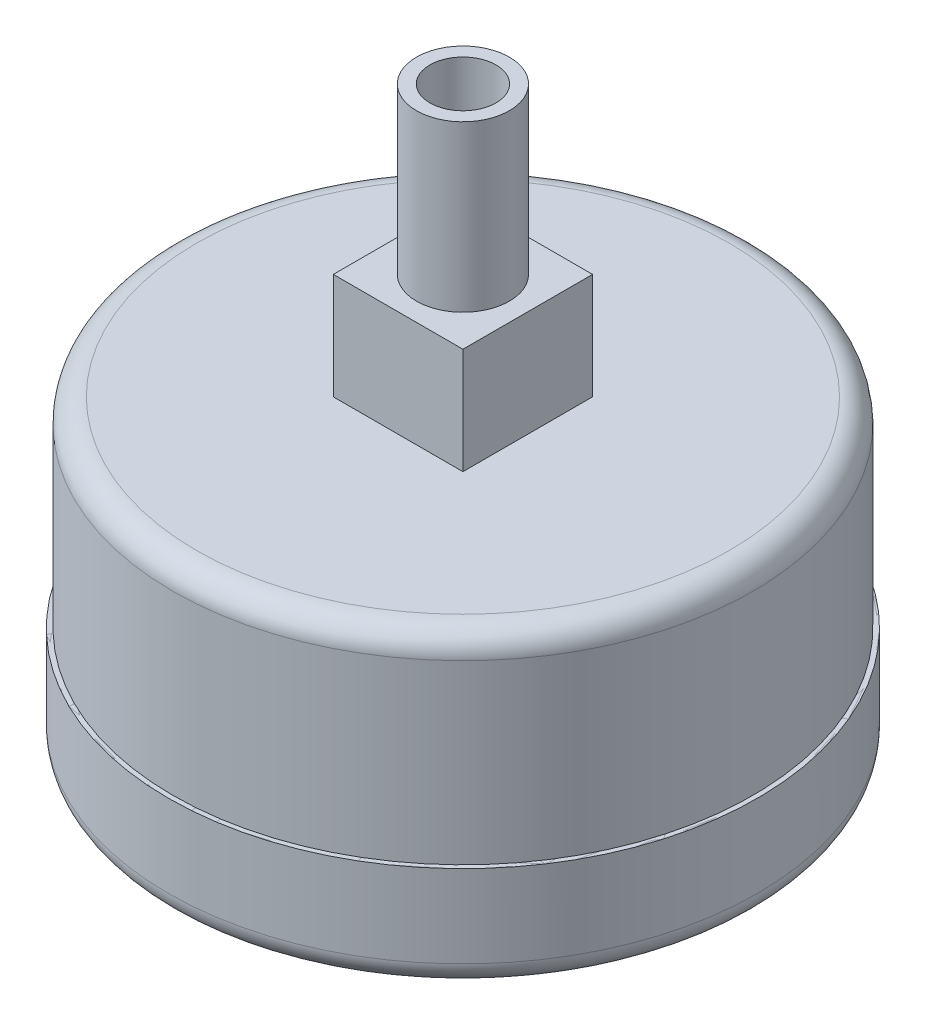
ISO-10303-21;
HEADER;
FILE_DESCRIPTION(('STEP AP214'),'2;1');
FILE_NAME('part.step','',(''),(''),'','','');
FILE_SCHEMA(('AUTOMOTIVE_DESIGN { 1 0 10303 214 1 1 1 1 }'));
ENDSEC;
DATA;
#1=APPLICATION_CONTEXT('core data for automotive mechanical design processes');
#2=APPLICATION_PROTOCOL_DEFINITION('international standard','automotive_design',2000,#1);
#3=PRODUCT_CONTEXT('',#1,'mechanical');
#4=PRODUCT('Part','Part','',(#3));
#5=PRODUCT_RELATED_PRODUCT_CATEGORY('part','',(#4));
#6=PRODUCT_DEFINITION_FORMATION('','',#4);
#7=PRODUCT_DEFINITION_CONTEXT('part definition',#1,'design');
#8=PRODUCT_DEFINITION('design','',#6,#7);
#9=PRODUCT_DEFINITION_SHAPE('','',#8);
#10=(LENGTH_UNIT() NAMED_UNIT(*) SI_UNIT(.MILLI.,.METRE.));
#11=(NAMED_UNIT(*) PLANE_ANGLE_UNIT() SI_UNIT($,.RADIAN.));
#12=(NAMED_UNIT(*) SI_UNIT($,.STERADIAN.) SOLID_ANGLE_UNIT());
#13=UNCERTAINTY_MEASURE_WITH_UNIT(LENGTH_MEASURE(1.E-05),#10,'distance_accuracy_value','');
#14=(GEOMETRIC_REPRESENTATION_CONTEXT(3) GLOBAL_UNCERTAINTY_ASSIGNED_CONTEXT((#13)) GLOBAL_UNIT_ASSIGNED_CONTEXT((#10,
#11,#12)) REPRESENTATION_CONTEXT('',''));
#15=CARTESIAN_POINT('',(0.,0.,0.));
#16=DIRECTION('',(0.,0.,1.));
#17=DIRECTION('',(1.,0.,0.));
#18=AXIS2_PLACEMENT_3D('',#15,#16,#17);
#19=CARTESIAN_POINT('',(0.,11.43,0.));
#20=DIRECTION('',(0.,1.,0.));
#21=DIRECTION('',(0.,0.,1.));
#22=AXIS2_PLACEMENT_3D('',#19,#20,#21);
#23=PLANE('',#22);
#24=CARTESIAN_POINT('',(0.,11.43,0.));
#25=DIRECTION('',(0.,1.,0.));
#26=DIRECTION('',(0.,0.,1.));
#27=AXIS2_PLACEMENT_3D('',#24,#25,#26);
#28=CIRCLE('',#27,31.75);
#29=CARTESIAN_POINT('',(0.,11.43,31.75));
#30=VERTEX_POINT('',#29);
#31=EDGE_CURVE('P0_E12',#30,#30,#28,.T.);
#32=ORIENTED_EDGE('',*,*,#31,.T.);
#33=EDGE_LOOP('',(#32));
#34=FACE_BOUND('',#33,.T.);
#35=ADVANCED_FACE('P0_F38',(#34),#23,.T.);
#36=OPEN_SHELL('',(#35));
#37=SHELL_BASED_SURFACE_MODEL('P0_B2',(#36));
#38=CARTESIAN_POINT('',(0.,44.45,0.));
#39=DIRECTION('',(0.,-1.,0.));
#40=DIRECTION('',(0.,0.,-1.));
#41=AXIS2_PLACEMENT_3D('',#38,#39,#40);
#42=PLANE('',#41);
#43=CARTESIAN_POINT('',(0.,44.45,0.));
#44=DIRECTION('',(0.,-1.,0.));
#45=DIRECTION('',(0.,0.,-1.));
#46=AXIS2_PLACEMENT_3D('',#43,#44,#45);
#47=CIRCLE('',#46,3.556);
#48=CARTESIAN_POINT('',(0.,44.45,-3.556));
#49=VERTEX_POINT('',#48);
#50=EDGE_CURVE('P1_E109',#49,#49,#47,.F.);
#51=ORIENTED_EDGE('',*,*,#50,.T.);
#52=EDGE_LOOP('',(#51));
#53=FACE_BOUND('',#52,.T.);
#54=ADVANCED_FACE('P1_F16',(#53),#42,.F.);
#55=CARTESIAN_POINT('',(0.,53.34,0.));
#56=DIRECTION('',(0.,-1.,0.));
#57=DIRECTION('',(0.,0.,-1.));
#58=AXIS2_PLACEMENT_3D('',#55,#56,#57);
#59=CYLINDRICAL_SURFACE('',#58,3.556);
#60=CARTESIAN_POINT('',(0.,62.23,0.));
#61=DIRECTION('',(0.,-1.,0.));
#62=DIRECTION('',(0.,0.,-1.));
#63=AXIS2_PLACEMENT_3D('',#60,#61,#62);
#64=CIRCLE('',#63,3.556);
#65=CARTESIAN_POINT('',(0.,62.23,-3.556));
#66=VERTEX_POINT('',#65);
#67=EDGE_CURVE('P1_E106',#66,#66,#64,.T.);
#68=ORIENTED_EDGE('',*,*,#67,.F.);
#69=EDGE_LOOP('',(#68));
#70=FACE_BOUND('',#69,.T.);
#71=ORIENTED_EDGE('',*,*,#50,.F.);
#72=EDGE_LOOP('',(#71));
#73=FACE_BOUND('',#72,.T.);
#74=ADVANCED_FACE('P1_F300',(#70,#73),#59,.F.);
#75=CARTESIAN_POINT('',(0.,62.23,2.5019));
#76=DIRECTION('',(0.,1.,0.));
#77=DIRECTION('',(0.,0.,1.));
#78=AXIS2_PLACEMENT_3D('',#75,#76,#77);
#79=PLANE('',#78);
#80=CARTESIAN_POINT('',(0.,62.23,0.));
#81=DIRECTION('',(0.,1.,0.));
#82=DIRECTION('',(0.,0.,1.));
#83=AXIS2_PLACEMENT_3D('',#80,#81,#82);
#84=CIRCLE('',#83,5.0038);
#85=CARTESIAN_POINT('',(0.,62.23,5.0038));
#86=VERTEX_POINT('',#85);
#87=EDGE_CURVE('P1_E103',#86,#86,#84,.F.);
#88=ORIENTED_EDGE('',*,*,#87,.F.);
#89=EDGE_LOOP('',(#88));
#90=FACE_BOUND('',#89,.T.);
#91=ORIENTED_EDGE('',*,*,#67,.T.);
#92=EDGE_LOOP('',(#91));
#93=FACE_BOUND('',#92,.T.);
#94=ADVANCED_FACE('P1_F289',(#90,#93),#79,.T.);
#95=CARTESIAN_POINT('',(0.,53.34,0.));
#96=DIRECTION('',(0.,1.,0.));
#97=DIRECTION('',(0.,0.,1.));
#98=AXIS2_PLACEMENT_3D('',#95,#96,#97);
#99=CYLINDRICAL_SURFACE('',#98,5.0038);
#100=ORIENTED_EDGE('',*,*,#87,.T.);
#101=EDGE_LOOP('',(#100));
#102=FACE_BOUND('',#101,.T.);
#103=CARTESIAN_POINT('',(0.,44.45,0.));
#104=DIRECTION('',(0.,1.,0.));
#105=DIRECTION('',(0.,0.,1.));
#106=AXIS2_PLACEMENT_3D('',#103,#104,#105);
#107=CIRCLE('',#106,5.0038);
#108=CARTESIAN_POINT('',(0.,44.45,5.0038));
#109=VERTEX_POINT('',#108);
#110=EDGE_CURVE('P1_E79',#109,#109,#107,.T.);
#111=ORIENTED_EDGE('',*,*,#110,.T.);
#112=EDGE_LOOP('',(#111));
#113=FACE_BOUND('',#112,.T.);
#114=ADVANCED_FACE('P1_F284',(#102,#113),#99,.T.);
#115=CARTESIAN_POINT('',(0.,44.45,0.));
#116=DIRECTION('',(0.,-1.,0.));
#117=DIRECTION('',(0.,0.,-1.));
#118=AXIS2_PLACEMENT_3D('',#115,#116,#117);
#119=PLANE('',#118);
#120=ORIENTED_EDGE('',*,*,#110,.F.);
#121=EDGE_LOOP('',(#120));
#122=FACE_BOUND('',#121,.T.);
#123=DIRECTION('',(0.,0.,1.));
#124=VECTOR('',#123,1.);
#125=CARTESIAN_POINT('',(6.985,44.45,0.));
#126=LINE('',#125,#124);
#127=CARTESIAN_POINT('',(6.985,44.45,6.985));
#128=VERTEX_POINT('',#127);
#129=CARTESIAN_POINT('',(6.985,44.45,-6.985));
#130=VERTEX_POINT('',#129);
#131=EDGE_CURVE('P1_E70',#128,#130,#126,.F.);
#132=ORIENTED_EDGE('',*,*,#131,.T.);
#133=DIRECTION('',(1.,0.,0.));
#134=VECTOR('',#133,1.);
#135=CARTESIAN_POINT('',(0.,44.45,-6.985));
#136=LINE('',#135,#134);
#137=CARTESIAN_POINT('',(-6.985,44.45,-6.985));
#138=VERTEX_POINT('',#137);
#139=EDGE_CURVE('P1_E172',#130,#138,#136,.F.);
#140=ORIENTED_EDGE('',*,*,#139,.T.);
#141=DIRECTION('',(0.,0.,-1.));
#142=VECTOR('',#141,1.);
#143=CARTESIAN_POINT('',(-6.985,44.45,0.));
#144=LINE('',#143,#142);
#145=CARTESIAN_POINT('',(-6.985,44.45,6.985));
#146=VERTEX_POINT('',#145);
#147=EDGE_CURVE('P1_E82',#138,#146,#144,.F.);
#148=ORIENTED_EDGE('',*,*,#147,.T.);
#149=DIRECTION('',(-1.,0.,0.));
#150=VECTOR('',#149,1.);
#151=CARTESIAN_POINT('',(0.,44.45,6.985));
#152=LINE('',#151,#150);
#153=EDGE_CURVE('P1_E65',#146,#128,#152,.F.);
#154=ORIENTED_EDGE('',*,*,#153,.T.);
#155=EDGE_LOOP('',(#132,#140,#148,#154));
#156=FACE_BOUND('',#155,.T.);
#157=ADVANCED_FACE('P1_F81',(#122,#156),#119,.F.);
#158=CARTESIAN_POINT('',(6.985,38.735,0.));
#159=DIRECTION('',(-1.,0.,0.));
#160=DIRECTION('',(0.,0.,1.));
#161=AXIS2_PLACEMENT_3D('',#158,#159,#160);
#162=PLANE('',#161);
#163=DIRECTION('',(0.,1.,0.));
#164=VECTOR('',#163,1.);
#165=CARTESIAN_POINT('',(6.985,38.735,6.985));
#166=LINE('',#165,#164);
#167=CARTESIAN_POINT('',(6.985,33.02,6.985));
#168=VERTEX_POINT('',#167);
#169=EDGE_CURVE('P1_E72',#128,#168,#166,.F.);
#170=ORIENTED_EDGE('',*,*,#169,.T.);
#171=DIRECTION('',(0.,0.,1.));
#172=VECTOR('',#171,1.);
#173=CARTESIAN_POINT('',(6.985,33.02,14.351));
#174=LINE('',#173,#172);
#175=CARTESIAN_POINT('',(6.985,33.02,-6.985));
#176=VERTEX_POINT('',#175);
#177=EDGE_CURVE('P1_E179',#176,#168,#174,.T.);
#178=ORIENTED_EDGE('',*,*,#177,.F.);
#179=DIRECTION('',(0.,1.,0.));
#180=VECTOR('',#179,1.);
#181=CARTESIAN_POINT('',(6.985,38.735,-6.985));
#182=LINE('',#181,#180);
#183=EDGE_CURVE('P1_E75',#176,#130,#182,.T.);
#184=ORIENTED_EDGE('',*,*,#183,.T.);
#185=ORIENTED_EDGE('',*,*,#131,.F.);
#186=EDGE_LOOP('',(#170,#178,#184,#185));
#187=FACE_BOUND('',#186,.T.);
#188=ADVANCED_FACE('P1_F71',(#187),#162,.F.);
#189=CARTESIAN_POINT('',(0.,38.735,6.985));
#190=DIRECTION('',(0.,0.,-1.));
#191=DIRECTION('',(-1.,0.,0.));
#192=AXIS2_PLACEMENT_3D('',#189,#190,#191);
#193=PLANE('',#192);
#194=DIRECTION('',(0.,1.,0.));
#195=VECTOR('',#194,1.);
#196=CARTESIAN_POINT('',(-6.985,38.735,6.985));
#197=LINE('',#196,#195);
#198=CARTESIAN_POINT('',(-6.985,33.02,6.985));
#199=VERTEX_POINT('',#198);
#200=EDGE_CURVE('P1_E84',#146,#199,#197,.F.);
#201=ORIENTED_EDGE('',*,*,#200,.T.);
#202=DIRECTION('',(1.,0.,0.));
#203=VECTOR('',#202,1.);
#204=CARTESIAN_POINT('',(0.,33.02,6.985));
#205=LINE('',#204,#203);
#206=EDGE_CURVE('P1_E88',#168,#199,#205,.F.);
#207=ORIENTED_EDGE('',*,*,#206,.F.);
#208=ORIENTED_EDGE('',*,*,#169,.F.);
#209=ORIENTED_EDGE('',*,*,#153,.F.);
#210=EDGE_LOOP('',(#201,#207,#208,#209));
#211=FACE_BOUND('',#210,.T.);
#212=ADVANCED_FACE('P1_F86',(#211),#193,.F.);
#213=CARTESIAN_POINT('',(-6.985,38.735,0.));
#214=DIRECTION('',(1.,0.,0.));
#215=DIRECTION('',(0.,0.,-1.));
#216=AXIS2_PLACEMENT_3D('',#213,#214,#215);
#217=PLANE('',#216);
#218=DIRECTION('',(0.,1.,0.));
#219=VECTOR('',#218,1.);
#220=CARTESIAN_POINT('',(-6.985,38.735,-6.985));
#221=LINE('',#220,#219);
#222=CARTESIAN_POINT('',(-6.985,33.02,-6.985));
#223=VERTEX_POINT('',#222);
#224=EDGE_CURVE('P1_E181',#138,#223,#221,.F.);
#225=ORIENTED_EDGE('',*,*,#224,.T.);
#226=DIRECTION('',(0.,0.,1.));
#227=VECTOR('',#226,1.);
#228=CARTESIAN_POINT('',(-6.985,33.02,14.351));
#229=LINE('',#228,#227);
#230=EDGE_CURVE('P1_E186',#199,#223,#229,.F.);
#231=ORIENTED_EDGE('',*,*,#230,.F.);
#232=ORIENTED_EDGE('',*,*,#200,.F.);
#233=ORIENTED_EDGE('',*,*,#147,.F.);
#234=EDGE_LOOP('',(#225,#231,#232,#233));
#235=FACE_BOUND('',#234,.T.);
#236=ADVANCED_FACE('P1_F187',(#235),#217,.F.);
#237=CARTESIAN_POINT('',(0.,38.735,-6.985));
#238=DIRECTION('',(0.,0.,1.));
#239=DIRECTION('',(1.,0.,0.));
#240=AXIS2_PLACEMENT_3D('',#237,#238,#239);
#241=PLANE('',#240);
#242=ORIENTED_EDGE('',*,*,#183,.F.);
#243=DIRECTION('',(1.,0.,0.));
#244=VECTOR('',#243,1.);
#245=CARTESIAN_POINT('',(0.,33.02,-6.985));
#246=LINE('',#245,#244);
#247=EDGE_CURVE('P1_E192',#223,#176,#246,.T.);
#248=ORIENTED_EDGE('',*,*,#247,.F.);
#249=ORIENTED_EDGE('',*,*,#224,.F.);
#250=ORIENTED_EDGE('',*,*,#139,.F.);
#251=EDGE_LOOP('',(#242,#248,#249,#250));
#252=FACE_BOUND('',#251,.T.);
#253=ADVANCED_FACE('P1_F217',(#252),#241,.F.);
#254=CARTESIAN_POINT('',(0.,33.02,14.351));
#255=DIRECTION('',(0.,1.,0.));
#256=DIRECTION('',(0.,0.,1.));
#257=AXIS2_PLACEMENT_3D('',#254,#255,#256);
#258=PLANE('',#257);
#259=ORIENTED_EDGE('',*,*,#230,.T.);
#260=ORIENTED_EDGE('',*,*,#247,.T.);
#261=ORIENTED_EDGE('',*,*,#177,.T.);
#262=ORIENTED_EDGE('',*,*,#206,.T.);
#263=EDGE_LOOP('',(#259,#260,#261,#262));
#264=FACE_BOUND('',#263,.T.);
#265=CARTESIAN_POINT('',(0.,33.02,0.));
#266=DIRECTION('',(0.,-1.,0.));
#267=DIRECTION('',(0.,0.,-1.));
#268=AXIS2_PLACEMENT_3D('',#265,#266,#267);
#269=CIRCLE('',#268,28.702);
#270=CARTESIAN_POINT('',(0.,33.02,-28.702));
#271=VERTEX_POINT('',#270);
#272=CARTESIAN_POINT('',(0.,33.02,28.702));
#273=VERTEX_POINT('',#272);
#274=EDGE_CURVE('P1_E198',#271,#273,#269,.T.);
#275=ORIENTED_EDGE('',*,*,#274,.F.);
#276=CARTESIAN_POINT('',(0.,33.02,0.));
#277=DIRECTION('',(0.,-1.,0.));
#278=DIRECTION('',(0.,0.,1.));
#279=AXIS2_PLACEMENT_3D('',#276,#277,#278);
#280=CIRCLE('',#279,28.702);
#281=EDGE_CURVE('P1_E150',#273,#271,#280,.T.);
#282=ORIENTED_EDGE('',*,*,#281,.F.);
#283=EDGE_LOOP('',(#275,#282));
#284=FACE_BOUND('',#283,.T.);
#285=ADVANCED_FACE('P1_F160',(#264,#284),#258,.T.);
#286=CARTESIAN_POINT('',(0.,30.48,0.));
#287=DIRECTION('',(0.,1.,0.));
#288=DIRECTION('',(0.,0.,-1.));
#289=AXIS2_PLACEMENT_3D('',#286,#287,#288);
#290=TOROIDAL_SURFACE('',#289,28.702,2.54);
#291=CARTESIAN_POINT('',(0.,30.48,0.));
#292=DIRECTION('',(0.,1.,0.));
#293=DIRECTION('',(0.,0.,1.));
#294=AXIS2_PLACEMENT_3D('',#291,#292,#293);
#295=CIRCLE('',#294,31.242);
#296=CARTESIAN_POINT('',(0.,30.48,31.242));
#297=VERTEX_POINT('',#296);
#298=EDGE_CURVE('P1_E100',#297,#297,#295,.F.);
#299=ORIENTED_EDGE('',*,*,#298,.F.);
#300=EDGE_LOOP('',(#299));
#301=FACE_BOUND('',#300,.T.);
#302=ORIENTED_EDGE('',*,*,#281,.T.);
#303=ORIENTED_EDGE('',*,*,#274,.T.);
#304=EDGE_LOOP('',(#302,#303));
#305=FACE_BOUND('',#304,.T.);
#306=ADVANCED_FACE('P1_F154',(#301,#305),#290,.T.);
#307=CARTESIAN_POINT('',(0.,20.955,0.));
#308=DIRECTION('',(0.,1.,0.));
#309=DIRECTION('',(0.,0.,1.));
#310=AXIS2_PLACEMENT_3D('',#307,#308,#309);
#311=CYLINDRICAL_SURFACE('',#310,31.242);
#312=ORIENTED_EDGE('',*,*,#298,.T.);
#313=EDGE_LOOP('',(#312));
#314=FACE_BOUND('',#313,.T.);
#315=CARTESIAN_POINT('',(0.,11.43,0.));
#316=DIRECTION('',(0.,1.,0.));
#317=DIRECTION('',(0.,0.,1.));
#318=AXIS2_PLACEMENT_3D('',#315,#316,#317);
#319=CIRCLE('',#318,31.242);
#320=CARTESIAN_POINT('',(0.,11.43,31.242));
#321=VERTEX_POINT('',#320);
#322=EDGE_CURVE('P1_E97',#321,#321,#319,.F.);
#323=ORIENTED_EDGE('',*,*,#322,.F.);
#324=EDGE_LOOP('',(#323));
#325=FACE_BOUND('',#324,.T.);
#326=ADVANCED_FACE('P1_F159',(#314,#325),#311,.T.);
#327=CARTESIAN_POINT('',(0.,11.43,31.496));
#328=DIRECTION('',(0.,1.,0.));
#329=DIRECTION('',(0.,0.,1.));
#330=AXIS2_PLACEMENT_3D('',#327,#328,#329);
#331=PLANE('',#330);
#332=CARTESIAN_POINT('',(0.,11.43,0.));
#333=DIRECTION('',(0.,1.,0.));
#334=DIRECTION('',(0.,0.,1.));
#335=AXIS2_PLACEMENT_3D('',#332,#333,#334);
#336=CIRCLE('',#335,31.75);
#337=CARTESIAN_POINT('',(0.,11.43,31.75));
#338=VERTEX_POINT('',#337);
#339=EDGE_CURVE('P1_E93',#338,#338,#336,.F.);
#340=ORIENTED_EDGE('',*,*,#339,.F.);
#341=EDGE_LOOP('',(#340));
#342=FACE_BOUND('',#341,.T.);
#343=ORIENTED_EDGE('',*,*,#322,.T.);
#344=EDGE_LOOP('',(#343));
#345=FACE_BOUND('',#344,.T.);
#346=ADVANCED_FACE('P1_F252',(#342,#345),#331,.T.);
#347=CARTESIAN_POINT('',(0.,6.985,0.));
#348=DIRECTION('',(0.,1.,0.));
#349=DIRECTION('',(0.,0.,1.));
#350=AXIS2_PLACEMENT_3D('',#347,#348,#349);
#351=CYLINDRICAL_SURFACE('',#350,31.75);
#352=ORIENTED_EDGE('',*,*,#339,.T.);
#353=EDGE_LOOP('',(#352));
#354=FACE_BOUND('',#353,.T.);
#355=CARTESIAN_POINT('',(0.,2.54,0.));
#356=DIRECTION('',(0.,1.,0.));
#357=DIRECTION('',(0.,0.,-1.));
#358=AXIS2_PLACEMENT_3D('',#355,#356,#357);
#359=CIRCLE('',#358,31.75);
#360=CARTESIAN_POINT('',(0.,2.54000000000001,-31.75));
#361=VERTEX_POINT('',#360);
#362=EDGE_CURVE('P1_E96',#361,#361,#359,.F.);
#363=ORIENTED_EDGE('',*,*,#362,.F.);
#364=EDGE_LOOP('',(#363));
#365=FACE_BOUND('',#364,.T.);
#366=ADVANCED_FACE('P1_F128',(#354,#365),#351,.T.);
#367=CARTESIAN_POINT('',(0.,2.54,0.));
#368=DIRECTION('',(0.,1.,0.));
#369=DIRECTION('',(0.,0.,-1.));
#370=AXIS2_PLACEMENT_3D('',#367,#368,#369);
#371=TOROIDAL_SURFACE('',#370,29.21,2.54);
#372=CARTESIAN_POINT('',(0.,0.,0.));
#373=DIRECTION('',(0.,1.,0.));
#374=DIRECTION('',(0.,0.,1.));
#375=AXIS2_PLACEMENT_3D('',#372,#373,#374);
#376=CIRCLE('',#375,29.21);
#377=CARTESIAN_POINT('',(0.,0.,-29.21));
#378=VERTEX_POINT('',#377);
#379=CARTESIAN_POINT('',(0.,0.,29.21));
#380=VERTEX_POINT('',#379);
#381=EDGE_CURVE('P1_E27',#378,#380,#376,.F.);
#382=ORIENTED_EDGE('',*,*,#381,.F.);
#383=CARTESIAN_POINT('',(0.,0.,0.));
#384=DIRECTION('',(0.,1.,0.));
#385=DIRECTION('',(0.,0.,-1.));
#386=AXIS2_PLACEMENT_3D('',#383,#384,#385);
#387=CIRCLE('',#386,29.21);
#388=EDGE_CURVE('P1_E11',#380,#378,#387,.F.);
#389=ORIENTED_EDGE('',*,*,#388,.F.);
#390=EDGE_LOOP('',(#382,#389));
#391=FACE_BOUND('',#390,.T.);
#392=ORIENTED_EDGE('',*,*,#362,.T.);
#393=EDGE_LOOP('',(#392));
#394=FACE_BOUND('',#393,.T.);
#395=ADVANCED_FACE('P1_F116',(#391,#394),#371,.T.);
#396=CARTESIAN_POINT('',(0.,0.,14.605));
#397=DIRECTION('',(0.,-1.,0.));
#398=DIRECTION('',(0.,0.,-1.));
#399=AXIS2_PLACEMENT_3D('',#396,#397,#398);
#400=PLANE('',#399);
#401=ORIENTED_EDGE('',*,*,#381,.T.);
#402=ORIENTED_EDGE('',*,*,#388,.T.);
#403=EDGE_LOOP('',(#401,#402));
#404=FACE_BOUND('',#403,.T.);
#405=ADVANCED_FACE('P1_F127',(#404),#400,.T.);
#406=CLOSED_SHELL('',(#54,#74,#94,#114,#157,#188,#212,#236,#253,#285,#306,#326,#346,#366,#395,#405));
#407=MANIFOLD_SOLID_BREP('P1_B1',#406);
#408=ADVANCED_BREP_SHAPE_REPRESENTATION('',(#18,#407),#14);
#409=MANIFOLD_SURFACE_SHAPE_REPRESENTATION('',(#18,#37),#14);
#410=SHAPE_REPRESENTATION('',(#18),#14);
#411=SHAPE_DEFINITION_REPRESENTATION(#9,#410);
#412=SHAPE_REPRESENTATION_RELATIONSHIP('','',#410,#408);
#413=SHAPE_REPRESENTATION_RELATIONSHIP('','',#410,#409);
ENDSEC;
END-ISO-10303-21;
